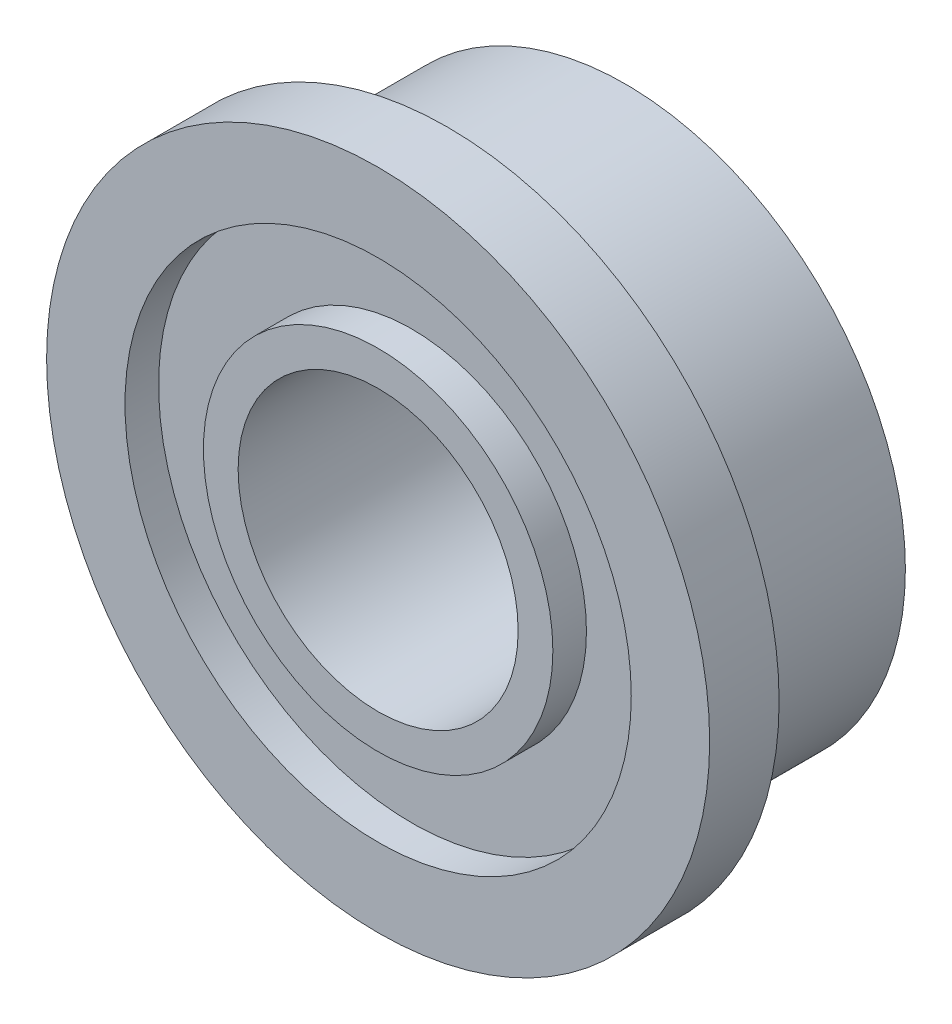
ISO-10303-21;
HEADER;
FILE_DESCRIPTION(('STEP AP214'),'2;1');
FILE_NAME('part.step','',(''),(''),'','','');
FILE_SCHEMA(('AUTOMOTIVE_DESIGN { 1 0 10303 214 1 1 1 1 }'));
ENDSEC;
DATA;
#1=APPLICATION_CONTEXT('core data for automotive mechanical design processes');
#2=APPLICATION_PROTOCOL_DEFINITION('international standard','automotive_design',2000,#1);
#3=PRODUCT_CONTEXT('',#1,'mechanical');
#4=PRODUCT('Part','Part','',(#3));
#5=PRODUCT_RELATED_PRODUCT_CATEGORY('part','',(#4));
#6=PRODUCT_DEFINITION_FORMATION('','',#4);
#7=PRODUCT_DEFINITION_CONTEXT('part definition',#1,'design');
#8=PRODUCT_DEFINITION('design','',#6,#7);
#9=PRODUCT_DEFINITION_SHAPE('','',#8);
#10=(LENGTH_UNIT() NAMED_UNIT(*) SI_UNIT(.MILLI.,.METRE.));
#11=(NAMED_UNIT(*) PLANE_ANGLE_UNIT() SI_UNIT($,.RADIAN.));
#12=(NAMED_UNIT(*) SI_UNIT($,.STERADIAN.) SOLID_ANGLE_UNIT());
#13=UNCERTAINTY_MEASURE_WITH_UNIT(LENGTH_MEASURE(1.E-05),#10,'distance_accuracy_value','');
#14=(GEOMETRIC_REPRESENTATION_CONTEXT(3) GLOBAL_UNCERTAINTY_ASSIGNED_CONTEXT((#13)) GLOBAL_UNIT_ASSIGNED_CONTEXT((#10,
#11,#12)) REPRESENTATION_CONTEXT('',''));
#15=CARTESIAN_POINT('',(0.,0.,0.));
#16=DIRECTION('',(0.,0.,1.));
#17=DIRECTION('',(1.,0.,0.));
#18=AXIS2_PLACEMENT_3D('',#15,#16,#17);
#19=CARTESIAN_POINT('',(0.,0.,2.803525));
#20=DIRECTION('',(0.,0.,1.));
#21=DIRECTION('',(1.,0.,0.));
#22=AXIS2_PLACEMENT_3D('',#19,#20,#21);
#23=PLANE('',#22);
#24=CARTESIAN_POINT('',(0.,0.,2.803525));
#25=DIRECTION('',(0.,0.,1.));
#26=DIRECTION('',(1.,0.,0.));
#27=AXIS2_PLACEMENT_3D('',#24,#25,#26);
#28=CIRCLE('',#27,1.5875);
#29=CARTESIAN_POINT('',(1.5875,0.,2.803525));
#30=VERTEX_POINT('',#29);
#31=EDGE_CURVE('E65',#30,#30,#28,.T.);
#32=ORIENTED_EDGE('',*,*,#31,.F.);
#33=EDGE_LOOP('',(#32));
#34=FACE_BOUND('',#33,.T.);
#35=CARTESIAN_POINT('',(0.,0.,2.803525));
#36=DIRECTION('',(0.,0.,1.));
#37=DIRECTION('',(1.,0.,0.));
#38=AXIS2_PLACEMENT_3D('',#35,#36,#37);
#39=CIRCLE('',#38,1.9812);
#40=CARTESIAN_POINT('',(1.9812,0.,2.803525));
#41=VERTEX_POINT('',#40);
#42=EDGE_CURVE('E77',#41,#41,#39,.T.);
#43=ORIENTED_EDGE('',*,*,#42,.T.);
#44=EDGE_LOOP('',(#43));
#45=FACE_BOUND('',#44,.T.);
#46=ADVANCED_FACE('F46',(#34,#45),#23,.T.);
#47=CARTESIAN_POINT('',(0.,0.,0.));
#48=DIRECTION('',(0.,0.,1.));
#49=DIRECTION('',(1.,0.,0.));
#50=AXIS2_PLACEMENT_3D('',#47,#48,#49);
#51=PLANE('',#50);
#52=CARTESIAN_POINT('',(0.,0.,0.));
#53=DIRECTION('',(0.,0.,1.));
#54=DIRECTION('',(1.,0.,0.));
#55=AXIS2_PLACEMENT_3D('',#52,#53,#54);
#56=CIRCLE('',#55,3.175);
#57=CARTESIAN_POINT('',(3.175,0.,0.));
#58=VERTEX_POINT('',#57);
#59=EDGE_CURVE('E50',#58,#58,#56,.T.);
#60=ORIENTED_EDGE('',*,*,#59,.F.);
#61=EDGE_LOOP('',(#60));
#62=FACE_BOUND('',#61,.T.);
#63=CARTESIAN_POINT('',(0.,0.,0.));
#64=DIRECTION('',(0.,0.,1.));
#65=DIRECTION('',(1.,0.,0.));
#66=AXIS2_PLACEMENT_3D('',#63,#64,#65);
#67=CIRCLE('',#66,1.5875);
#68=CARTESIAN_POINT('',(1.5875,0.,0.));
#69=VERTEX_POINT('',#68);
#70=EDGE_CURVE('E57',#69,#69,#67,.T.);
#71=ORIENTED_EDGE('',*,*,#70,.T.);
#72=EDGE_LOOP('',(#71));
#73=FACE_BOUND('',#72,.T.);
#74=ADVANCED_FACE('F120',(#62,#73),#51,.F.);
#75=CARTESIAN_POINT('',(0.,0.,2.016125));
#76=DIRECTION('',(0.,0.,-1.));
#77=DIRECTION('',(-1.,0.,0.));
#78=AXIS2_PLACEMENT_3D('',#75,#76,#77);
#79=CYLINDRICAL_SURFACE('',#78,3.175);
#80=CARTESIAN_POINT('',(0.,0.,2.016125));
#81=DIRECTION('',(0.,0.,1.));
#82=DIRECTION('',(1.,0.,0.));
#83=AXIS2_PLACEMENT_3D('',#80,#81,#82);
#84=CIRCLE('',#83,3.175);
#85=CARTESIAN_POINT('',(3.175,0.,2.016125));
#86=VERTEX_POINT('',#85);
#87=EDGE_CURVE('E12',#86,#86,#84,.T.);
#88=ORIENTED_EDGE('',*,*,#87,.F.);
#89=EDGE_LOOP('',(#88));
#90=FACE_BOUND('',#89,.T.);
#91=ORIENTED_EDGE('',*,*,#59,.T.);
#92=EDGE_LOOP('',(#91));
#93=FACE_BOUND('',#92,.T.);
#94=ADVANCED_FACE('F48',(#90,#93),#79,.T.);
#95=CARTESIAN_POINT('',(0.,0.,2.016125));
#96=DIRECTION('',(0.,0.,-1.));
#97=DIRECTION('',(-1.,0.,0.));
#98=AXIS2_PLACEMENT_3D('',#95,#96,#97);
#99=CYLINDRICAL_SURFACE('',#98,1.5875);
#100=ORIENTED_EDGE('',*,*,#70,.F.);
#101=EDGE_LOOP('',(#100));
#102=FACE_BOUND('',#101,.T.);
#103=ORIENTED_EDGE('',*,*,#31,.T.);
#104=EDGE_LOOP('',(#103));
#105=FACE_BOUND('',#104,.T.);
#106=ADVANCED_FACE('F112',(#102,#105),#99,.F.);
#107=CARTESIAN_POINT('',(0.,0.,2.016125));
#108=DIRECTION('',(0.,0.,1.));
#109=DIRECTION('',(1.,0.,0.));
#110=AXIS2_PLACEMENT_3D('',#107,#108,#109);
#111=PLANE('',#110);
#112=CARTESIAN_POINT('',(0.,0.,2.016125));
#113=DIRECTION('',(0.,0.,1.));
#114=DIRECTION('',(1.,0.,0.));
#115=AXIS2_PLACEMENT_3D('',#112,#113,#114);
#116=CIRCLE('',#115,3.7592);
#117=CARTESIAN_POINT('',(3.7592,0.,2.016125));
#118=VERTEX_POINT('',#117);
#119=EDGE_CURVE('E62',#118,#118,#116,.T.);
#120=ORIENTED_EDGE('',*,*,#119,.F.);
#121=EDGE_LOOP('',(#120));
#122=FACE_BOUND('',#121,.T.);
#123=ORIENTED_EDGE('',*,*,#87,.T.);
#124=EDGE_LOOP('',(#123));
#125=FACE_BOUND('',#124,.T.);
#126=ADVANCED_FACE('F102',(#122,#125),#111,.F.);
#127=CARTESIAN_POINT('',(0.,0.,2.803525));
#128=DIRECTION('',(0.,0.,1.));
#129=DIRECTION('',(1.,0.,0.));
#130=AXIS2_PLACEMENT_3D('',#127,#128,#129);
#131=CIRCLE('',#130,2.8702);
#132=CARTESIAN_POINT('',(2.8702,0.,2.803525));
#133=VERTEX_POINT('',#132);
#134=EDGE_CURVE('E71',#133,#133,#131,.T.);
#135=ORIENTED_EDGE('',*,*,#134,.F.);
#136=EDGE_LOOP('',(#135));
#137=FACE_BOUND('',#136,.T.);
#138=CARTESIAN_POINT('',(0.,0.,2.803525));
#139=DIRECTION('',(0.,0.,1.));
#140=DIRECTION('',(1.,0.,0.));
#141=AXIS2_PLACEMENT_3D('',#138,#139,#140);
#142=CIRCLE('',#141,3.7592);
#143=CARTESIAN_POINT('',(3.7592,0.,2.803525));
#144=VERTEX_POINT('',#143);
#145=EDGE_CURVE('E61',#144,#144,#142,.T.);
#146=ORIENTED_EDGE('',*,*,#145,.T.);
#147=EDGE_LOOP('',(#146));
#148=FACE_BOUND('',#147,.T.);
#149=ADVANCED_FACE('F99',(#137,#148),#23,.T.);
#150=CARTESIAN_POINT('',(0.,0.,2.803525));
#151=DIRECTION('',(0.,0.,-1.));
#152=DIRECTION('',(-1.,0.,0.));
#153=AXIS2_PLACEMENT_3D('',#150,#151,#152);
#154=CYLINDRICAL_SURFACE('',#153,3.7592);
#155=ORIENTED_EDGE('',*,*,#145,.F.);
#156=EDGE_LOOP('',(#155));
#157=FACE_BOUND('',#156,.T.);
#158=ORIENTED_EDGE('',*,*,#119,.T.);
#159=EDGE_LOOP('',(#158));
#160=FACE_BOUND('',#159,.T.);
#161=ADVANCED_FACE('F95',(#157,#160),#154,.T.);
#162=CARTESIAN_POINT('',(0.,0.,2.422525));
#163=DIRECTION('',(0.,0.,1.));
#164=DIRECTION('',(1.,0.,0.));
#165=AXIS2_PLACEMENT_3D('',#162,#163,#164);
#166=CYLINDRICAL_SURFACE('',#165,2.8702);
#167=CARTESIAN_POINT('',(0.,0.,2.422525));
#168=DIRECTION('',(0.,0.,1.));
#169=DIRECTION('',(1.,0.,0.));
#170=AXIS2_PLACEMENT_3D('',#167,#168,#169);
#171=CIRCLE('',#170,2.8702);
#172=CARTESIAN_POINT('',(2.8702,0.,2.422525));
#173=VERTEX_POINT('',#172);
#174=EDGE_CURVE('E70',#173,#173,#171,.T.);
#175=ORIENTED_EDGE('',*,*,#174,.F.);
#176=EDGE_LOOP('',(#175));
#177=FACE_BOUND('',#176,.T.);
#178=ORIENTED_EDGE('',*,*,#134,.T.);
#179=EDGE_LOOP('',(#178));
#180=FACE_BOUND('',#179,.T.);
#181=ADVANCED_FACE('F89',(#177,#180),#166,.F.);
#182=CARTESIAN_POINT('',(0.,0.,2.422525));
#183=DIRECTION('',(0.,0.,1.));
#184=DIRECTION('',(1.,0.,0.));
#185=AXIS2_PLACEMENT_3D('',#182,#183,#184);
#186=PLANE('',#185);
#187=CARTESIAN_POINT('',(0.,0.,2.422525));
#188=DIRECTION('',(0.,0.,1.));
#189=DIRECTION('',(1.,0.,0.));
#190=AXIS2_PLACEMENT_3D('',#187,#188,#189);
#191=CIRCLE('',#190,1.9812);
#192=CARTESIAN_POINT('',(1.9812,0.,2.422525));
#193=VERTEX_POINT('',#192);
#194=EDGE_CURVE('E74',#193,#193,#191,.T.);
#195=ORIENTED_EDGE('',*,*,#194,.F.);
#196=EDGE_LOOP('',(#195));
#197=FACE_BOUND('',#196,.T.);
#198=ORIENTED_EDGE('',*,*,#174,.T.);
#199=EDGE_LOOP('',(#198));
#200=FACE_BOUND('',#199,.T.);
#201=ADVANCED_FACE('F86',(#197,#200),#186,.T.);
#202=CARTESIAN_POINT('',(0.,0.,2.422525));
#203=DIRECTION('',(0.,0.,1.));
#204=DIRECTION('',(1.,0.,0.));
#205=AXIS2_PLACEMENT_3D('',#202,#203,#204);
#206=CYLINDRICAL_SURFACE('',#205,1.9812);
#207=ORIENTED_EDGE('',*,*,#194,.T.);
#208=EDGE_LOOP('',(#207));
#209=FACE_BOUND('',#208,.T.);
#210=ORIENTED_EDGE('',*,*,#42,.F.);
#211=EDGE_LOOP('',(#210));
#212=FACE_BOUND('',#211,.T.);
#213=ADVANCED_FACE('F83',(#209,#212),#206,.T.);
#214=CLOSED_SHELL('',(#46,#74,#94,#106,#126,#149,#161,#181,#201,#213));
#215=MANIFOLD_SOLID_BREP('B2',#214);
#216=ADVANCED_BREP_SHAPE_REPRESENTATION('',(#18,#215),#14);
#217=SHAPE_DEFINITION_REPRESENTATION(#9,#216);
ENDSEC;
END-ISO-10303-21;
